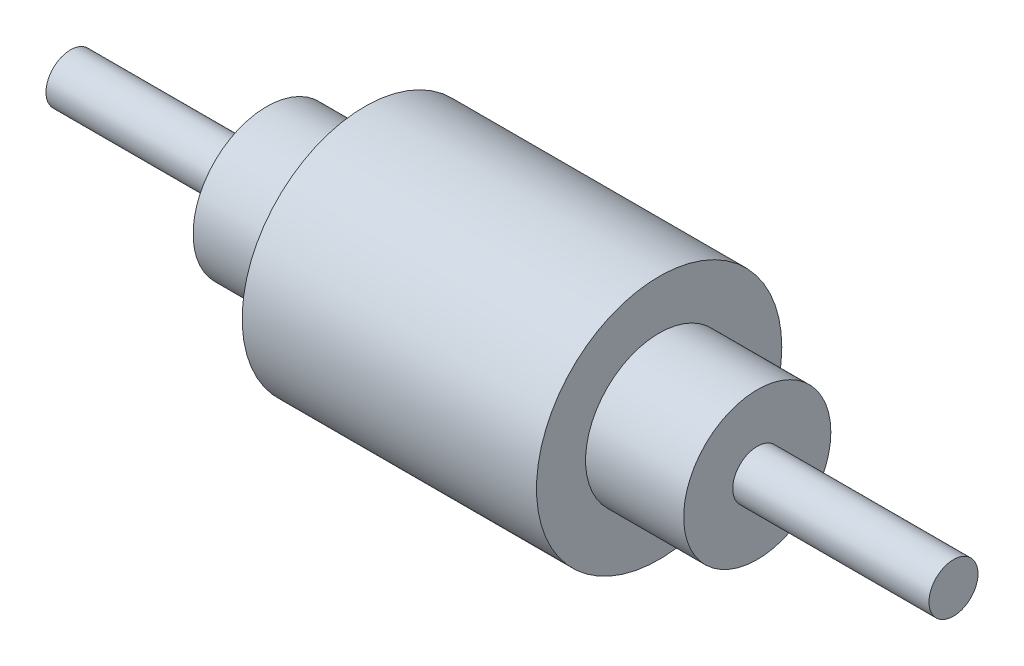
ISO-10303-21;
HEADER;
FILE_DESCRIPTION(('STEP AP214'),'2;1');
FILE_NAME('part.step','',(''),(''),'','','');
FILE_SCHEMA(('AUTOMOTIVE_DESIGN { 1 0 10303 214 1 1 1 1 }'));
ENDSEC;
DATA;
#1=APPLICATION_CONTEXT('core data for automotive mechanical design processes');
#2=APPLICATION_PROTOCOL_DEFINITION('international standard','automotive_design',2000,#1);
#3=PRODUCT_CONTEXT('',#1,'mechanical');
#4=PRODUCT('Part','Part','',(#3));
#5=PRODUCT_RELATED_PRODUCT_CATEGORY('part','',(#4));
#6=PRODUCT_DEFINITION_FORMATION('','',#4);
#7=PRODUCT_DEFINITION_CONTEXT('part definition',#1,'design');
#8=PRODUCT_DEFINITION('design','',#6,#7);
#9=PRODUCT_DEFINITION_SHAPE('','',#8);
#10=(LENGTH_UNIT() NAMED_UNIT(*) SI_UNIT(.MILLI.,.METRE.));
#11=(NAMED_UNIT(*) PLANE_ANGLE_UNIT() SI_UNIT($,.RADIAN.));
#12=(NAMED_UNIT(*) SI_UNIT($,.STERADIAN.) SOLID_ANGLE_UNIT());
#13=UNCERTAINTY_MEASURE_WITH_UNIT(LENGTH_MEASURE(1.E-05),#10,'distance_accuracy_value','');
#14=(GEOMETRIC_REPRESENTATION_CONTEXT(3) GLOBAL_UNCERTAINTY_ASSIGNED_CONTEXT((#13)) GLOBAL_UNIT_ASSIGNED_CONTEXT((#10,
#11,#12)) REPRESENTATION_CONTEXT('',''));
#15=CARTESIAN_POINT('',(0.,0.,0.));
#16=DIRECTION('',(0.,0.,1.));
#17=DIRECTION('',(1.,0.,0.));
#18=AXIS2_PLACEMENT_3D('',#15,#16,#17);
#19=CARTESIAN_POINT('',(180.,0.,0.));
#20=DIRECTION('',(1.,0.,0.));
#21=DIRECTION('',(0.,0.,-1.));
#22=AXIS2_PLACEMENT_3D('',#19,#20,#21);
#23=PLANE('',#22);
#24=CARTESIAN_POINT('',(180.,0.,0.));
#25=DIRECTION('',(1.,0.,0.));
#26=DIRECTION('',(0.,0.,-1.));
#27=AXIS2_PLACEMENT_3D('',#24,#25,#26);
#28=CIRCLE('',#27,10.);
#29=CARTESIAN_POINT('',(180.,0.,-10.));
#30=VERTEX_POINT('',#29);
#31=EDGE_CURVE('E10',#30,#30,#28,.T.);
#32=ORIENTED_EDGE('',*,*,#31,.T.);
#33=EDGE_LOOP('',(#32));
#34=FACE_BOUND('',#33,.T.);
#35=ADVANCED_FACE('F37',(#34),#23,.T.);
#36=CARTESIAN_POINT('',(180.,0.,0.));
#37=DIRECTION('',(1.,0.,0.));
#38=DIRECTION('',(0.,0.,-1.));
#39=AXIS2_PLACEMENT_3D('',#36,#37,#38);
#40=CYLINDRICAL_SURFACE('',#39,10.);
#41=CARTESIAN_POINT('',(100.,0.,0.));
#42=DIRECTION('',(1.,0.,0.));
#43=DIRECTION('',(0.,0.,-1.));
#44=AXIS2_PLACEMENT_3D('',#41,#42,#43);
#45=CIRCLE('',#44,10.);
#46=CARTESIAN_POINT('',(100.,0.,-10.));
#47=VERTEX_POINT('',#46);
#48=EDGE_CURVE('E44',#47,#47,#45,.T.);
#49=ORIENTED_EDGE('',*,*,#48,.T.);
#50=EDGE_LOOP('',(#49));
#51=FACE_BOUND('',#50,.T.);
#52=ORIENTED_EDGE('',*,*,#31,.F.);
#53=EDGE_LOOP('',(#52));
#54=FACE_BOUND('',#53,.T.);
#55=ADVANCED_FACE('F97',(#51,#54),#40,.T.);
#56=CARTESIAN_POINT('',(100.,0.,0.));
#57=DIRECTION('',(1.,0.,0.));
#58=DIRECTION('',(0.,0.,-1.));
#59=AXIS2_PLACEMENT_3D('',#56,#57,#58);
#60=PLANE('',#59);
#61=CARTESIAN_POINT('',(100.,0.,0.));
#62=DIRECTION('',(1.,0.,0.));
#63=DIRECTION('',(0.,0.,-1.));
#64=AXIS2_PLACEMENT_3D('',#61,#62,#63);
#65=CIRCLE('',#64,30.);
#66=CARTESIAN_POINT('',(100.,0.,-30.));
#67=VERTEX_POINT('',#66);
#68=EDGE_CURVE('E49',#67,#67,#65,.T.);
#69=ORIENTED_EDGE('',*,*,#68,.T.);
#70=EDGE_LOOP('',(#69));
#71=FACE_BOUND('',#70,.T.);
#72=ORIENTED_EDGE('',*,*,#48,.F.);
#73=EDGE_LOOP('',(#72));
#74=FACE_BOUND('',#73,.T.);
#75=ADVANCED_FACE('F101',(#71,#74),#60,.T.);
#76=CARTESIAN_POINT('',(180.,0.,0.));
#77=DIRECTION('',(1.,0.,0.));
#78=DIRECTION('',(0.,0.,-1.));
#79=AXIS2_PLACEMENT_3D('',#76,#77,#78);
#80=CYLINDRICAL_SURFACE('',#79,30.);
#81=CARTESIAN_POINT('',(60.,0.,0.));
#82=DIRECTION('',(1.,0.,0.));
#83=DIRECTION('',(0.,0.,-1.));
#84=AXIS2_PLACEMENT_3D('',#81,#82,#83);
#85=CIRCLE('',#84,30.);
#86=CARTESIAN_POINT('',(60.,0.,-30.));
#87=VERTEX_POINT('',#86);
#88=EDGE_CURVE('E54',#87,#87,#85,.T.);
#89=ORIENTED_EDGE('',*,*,#88,.T.);
#90=EDGE_LOOP('',(#89));
#91=FACE_BOUND('',#90,.T.);
#92=ORIENTED_EDGE('',*,*,#68,.F.);
#93=EDGE_LOOP('',(#92));
#94=FACE_BOUND('',#93,.T.);
#95=ADVANCED_FACE('F105',(#91,#94),#80,.T.);
#96=CARTESIAN_POINT('',(60.,0.,0.));
#97=DIRECTION('',(1.,0.,0.));
#98=DIRECTION('',(0.,0.,-1.));
#99=AXIS2_PLACEMENT_3D('',#96,#97,#98);
#100=PLANE('',#99);
#101=CARTESIAN_POINT('',(60.,0.,0.));
#102=DIRECTION('',(1.,0.,0.));
#103=DIRECTION('',(0.,0.,-1.));
#104=AXIS2_PLACEMENT_3D('',#101,#102,#103);
#105=CIRCLE('',#104,50.);
#106=CARTESIAN_POINT('',(60.,0.,-50.));
#107=VERTEX_POINT('',#106);
#108=EDGE_CURVE('E60',#107,#107,#105,.T.);
#109=ORIENTED_EDGE('',*,*,#108,.T.);
#110=EDGE_LOOP('',(#109));
#111=FACE_BOUND('',#110,.T.);
#112=ORIENTED_EDGE('',*,*,#88,.F.);
#113=EDGE_LOOP('',(#112));
#114=FACE_BOUND('',#113,.T.);
#115=ADVANCED_FACE('F112',(#111,#114),#100,.T.);
#116=CARTESIAN_POINT('',(180.,0.,0.));
#117=DIRECTION('',(1.,0.,0.));
#118=DIRECTION('',(0.,0.,-1.));
#119=AXIS2_PLACEMENT_3D('',#116,#117,#118);
#120=CYLINDRICAL_SURFACE('',#119,50.);
#121=ORIENTED_EDGE('',*,*,#108,.F.);
#122=EDGE_LOOP('',(#121));
#123=FACE_BOUND('',#122,.T.);
#124=CARTESIAN_POINT('',(-60.,0.,0.));
#125=DIRECTION('',(1.,0.,0.));
#126=DIRECTION('',(0.,0.,-1.));
#127=AXIS2_PLACEMENT_3D('',#124,#125,#126);
#128=CIRCLE('',#127,50.);
#129=CARTESIAN_POINT('',(-60.,0.,-50.));
#130=VERTEX_POINT('',#129);
#131=EDGE_CURVE('E64',#130,#130,#128,.T.);
#132=ORIENTED_EDGE('',*,*,#131,.T.);
#133=EDGE_LOOP('',(#132));
#134=FACE_BOUND('',#133,.T.);
#135=ADVANCED_FACE('F116',(#123,#134),#120,.T.);
#136=CARTESIAN_POINT('',(-60.,0.,0.));
#137=DIRECTION('',(1.,0.,0.));
#138=DIRECTION('',(0.,0.,-1.));
#139=AXIS2_PLACEMENT_3D('',#136,#137,#138);
#140=PLANE('',#139);
#141=ORIENTED_EDGE('',*,*,#131,.F.);
#142=EDGE_LOOP('',(#141));
#143=FACE_BOUND('',#142,.T.);
#144=CARTESIAN_POINT('',(-60.,0.,0.));
#145=DIRECTION('',(1.,0.,0.));
#146=DIRECTION('',(0.,0.,-1.));
#147=AXIS2_PLACEMENT_3D('',#144,#145,#146);
#148=CIRCLE('',#147,30.);
#149=CARTESIAN_POINT('',(-60.,0.,-30.));
#150=VERTEX_POINT('',#149);
#151=EDGE_CURVE('E68',#150,#150,#148,.T.);
#152=ORIENTED_EDGE('',*,*,#151,.T.);
#153=EDGE_LOOP('',(#152));
#154=FACE_BOUND('',#153,.T.);
#155=ADVANCED_FACE('F120',(#143,#154),#140,.F.);
#156=CARTESIAN_POINT('',(180.,0.,0.));
#157=DIRECTION('',(1.,0.,0.));
#158=DIRECTION('',(0.,0.,-1.));
#159=AXIS2_PLACEMENT_3D('',#156,#157,#158);
#160=CYLINDRICAL_SURFACE('',#159,30.);
#161=ORIENTED_EDGE('',*,*,#151,.F.);
#162=EDGE_LOOP('',(#161));
#163=FACE_BOUND('',#162,.T.);
#164=CARTESIAN_POINT('',(-100.,0.,0.));
#165=DIRECTION('',(1.,0.,0.));
#166=DIRECTION('',(0.,0.,-1.));
#167=AXIS2_PLACEMENT_3D('',#164,#165,#166);
#168=CIRCLE('',#167,30.);
#169=CARTESIAN_POINT('',(-100.,0.,-30.));
#170=VERTEX_POINT('',#169);
#171=EDGE_CURVE('E72',#170,#170,#168,.T.);
#172=ORIENTED_EDGE('',*,*,#171,.T.);
#173=EDGE_LOOP('',(#172));
#174=FACE_BOUND('',#173,.T.);
#175=ADVANCED_FACE('F124',(#163,#174),#160,.T.);
#176=CARTESIAN_POINT('',(-100.,0.,0.));
#177=DIRECTION('',(1.,0.,0.));
#178=DIRECTION('',(0.,0.,-1.));
#179=AXIS2_PLACEMENT_3D('',#176,#177,#178);
#180=PLANE('',#179);
#181=ORIENTED_EDGE('',*,*,#171,.F.);
#182=EDGE_LOOP('',(#181));
#183=FACE_BOUND('',#182,.T.);
#184=CARTESIAN_POINT('',(-100.,0.,0.));
#185=DIRECTION('',(1.,0.,0.));
#186=DIRECTION('',(0.,0.,-1.));
#187=AXIS2_PLACEMENT_3D('',#184,#185,#186);
#188=CIRCLE('',#187,10.);
#189=CARTESIAN_POINT('',(-100.,0.,-10.));
#190=VERTEX_POINT('',#189);
#191=EDGE_CURVE('E76',#190,#190,#188,.T.);
#192=ORIENTED_EDGE('',*,*,#191,.T.);
#193=EDGE_LOOP('',(#192));
#194=FACE_BOUND('',#193,.T.);
#195=ADVANCED_FACE('F93',(#183,#194),#180,.F.);
#196=CARTESIAN_POINT('',(180.,0.,0.));
#197=DIRECTION('',(1.,0.,0.));
#198=DIRECTION('',(0.,0.,-1.));
#199=AXIS2_PLACEMENT_3D('',#196,#197,#198);
#200=CYLINDRICAL_SURFACE('',#199,10.);
#201=ORIENTED_EDGE('',*,*,#191,.F.);
#202=EDGE_LOOP('',(#201));
#203=FACE_BOUND('',#202,.T.);
#204=CARTESIAN_POINT('',(-180.,0.,0.));
#205=DIRECTION('',(1.,0.,0.));
#206=DIRECTION('',(0.,0.,-1.));
#207=AXIS2_PLACEMENT_3D('',#204,#205,#206);
#208=CIRCLE('',#207,10.);
#209=CARTESIAN_POINT('',(-180.,0.,-10.));
#210=VERTEX_POINT('',#209);
#211=EDGE_CURVE('E80',#210,#210,#208,.T.);
#212=ORIENTED_EDGE('',*,*,#211,.T.);
#213=EDGE_LOOP('',(#212));
#214=FACE_BOUND('',#213,.T.);
#215=ADVANCED_FACE('F85',(#203,#214),#200,.T.);
#216=CARTESIAN_POINT('',(-180.,0.,0.));
#217=DIRECTION('',(1.,0.,0.));
#218=DIRECTION('',(0.,0.,-1.));
#219=AXIS2_PLACEMENT_3D('',#216,#217,#218);
#220=PLANE('',#219);
#221=ORIENTED_EDGE('',*,*,#211,.F.);
#222=EDGE_LOOP('',(#221));
#223=FACE_BOUND('',#222,.T.);
#224=ADVANCED_FACE('F87',(#223),#220,.F.);
#225=CLOSED_SHELL('',(#35,#55,#75,#95,#115,#135,#155,#175,#195,#215,#224));
#226=MANIFOLD_SOLID_BREP('B2',#225);
#227=ADVANCED_BREP_SHAPE_REPRESENTATION('',(#18,#226),#14);
#228=SHAPE_DEFINITION_REPRESENTATION(#9,#227);
ENDSEC;
END-ISO-10303-21;
